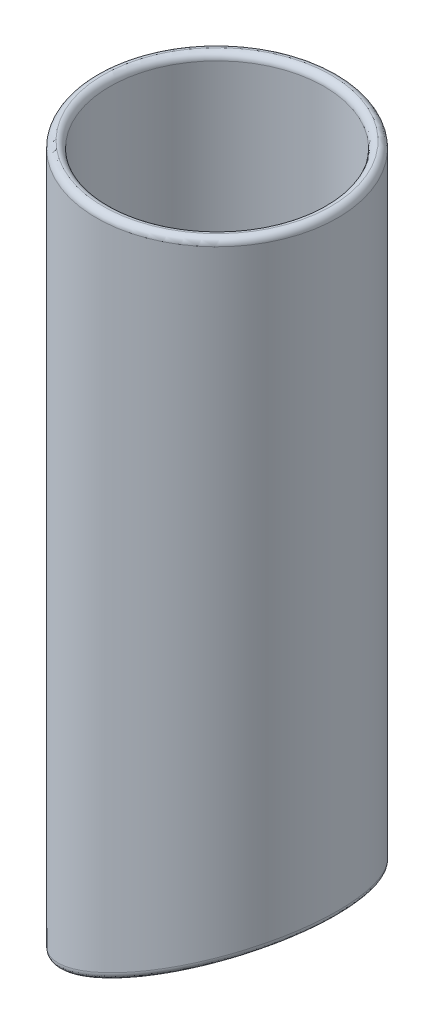
ISO-10303-21;
HEADER;
FILE_DESCRIPTION(('STEP AP214'),'2;1');
FILE_NAME('part.step','',(''),(''),'','','');
FILE_SCHEMA(('AUTOMOTIVE_DESIGN { 1 0 10303 214 1 1 1 1 }'));
ENDSEC;
DATA;
#1=APPLICATION_CONTEXT('core data for automotive mechanical design processes');
#2=APPLICATION_PROTOCOL_DEFINITION('international standard','automotive_design',2000,#1);
#3=PRODUCT_CONTEXT('',#1,'mechanical');
#4=PRODUCT('Part','Part','',(#3));
#5=PRODUCT_RELATED_PRODUCT_CATEGORY('part','',(#4));
#6=PRODUCT_DEFINITION_FORMATION('','',#4);
#7=PRODUCT_DEFINITION_CONTEXT('part definition',#1,'design');
#8=PRODUCT_DEFINITION('design','',#6,#7);
#9=PRODUCT_DEFINITION_SHAPE('','',#8);
#10=(LENGTH_UNIT() NAMED_UNIT(*) SI_UNIT(.MILLI.,.METRE.));
#11=(NAMED_UNIT(*) PLANE_ANGLE_UNIT() SI_UNIT($,.RADIAN.));
#12=(NAMED_UNIT(*) SI_UNIT($,.STERADIAN.) SOLID_ANGLE_UNIT());
#13=UNCERTAINTY_MEASURE_WITH_UNIT(LENGTH_MEASURE(1.E-05),#10,'distance_accuracy_value','');
#14=(GEOMETRIC_REPRESENTATION_CONTEXT(3) GLOBAL_UNCERTAINTY_ASSIGNED_CONTEXT((#13)) GLOBAL_UNIT_ASSIGNED_CONTEXT((#10,
#11,#12)) REPRESENTATION_CONTEXT('',''));
#15=CARTESIAN_POINT('',(0.,0.,0.));
#16=DIRECTION('',(0.,0.,1.));
#17=DIRECTION('',(1.,0.,0.));
#18=AXIS2_PLACEMENT_3D('',#15,#16,#17);
#19=CARTESIAN_POINT('',(0.,0.,0.));
#20=DIRECTION('',(0.,-1.,0.));
#21=DIRECTION('',(0.,0.,-1.));
#22=AXIS2_PLACEMENT_3D('',#19,#20,#21);
#23=CYLINDRICAL_SURFACE('',#22,2.032);
#24=CARTESIAN_POINT('',(0.,6.66237066588943,0.));
#25=DIRECTION('',(-0.422618261740694,0.906307787036652,0.));
#26=DIRECTION('',(-0.906307787036652,-0.422618261740694,0.));
#27=AXIS2_PLACEMENT_3D('',#24,#25,#26);
#28=ELLIPSE('',#27,2.24206393133178,2.032);
#29=CARTESIAN_POINT('',(-2.032,5.71483350451849,0.));
#30=VERTEX_POINT('',#29);
#31=EDGE_CURVE('E85',#30,#30,#28,.F.);
#32=ORIENTED_EDGE('',*,*,#31,.T.);
#33=EDGE_LOOP('',(#32));
#34=FACE_BOUND('',#33,.T.);
#35=CARTESIAN_POINT('',(0.,14.2343500797453,0.));
#36=DIRECTION('',(0.,-1.,0.));
#37=DIRECTION('',(0.,0.,-1.));
#38=AXIS2_PLACEMENT_3D('',#35,#36,#37);
#39=CIRCLE('',#38,2.032);
#40=CARTESIAN_POINT('',(0.,14.2343500797453,-2.032));
#41=VERTEX_POINT('',#40);
#42=EDGE_CURVE('E88',#41,#41,#39,.T.);
#43=ORIENTED_EDGE('',*,*,#42,.F.);
#44=EDGE_LOOP('',(#43));
#45=FACE_BOUND('',#44,.T.);
#46=ADVANCED_FACE('F33',(#34,#45),#23,.F.);
#47=CARTESIAN_POINT('',(0.,14.2343500797453,0.));
#48=DIRECTION('',(0.,1.,0.));
#49=DIRECTION('',(0.,0.,1.));
#50=AXIS2_PLACEMENT_3D('',#47,#48,#49);
#51=CONICAL_SURFACE('',#50,2.032,1.02974425867666);
#52=CARTESIAN_POINT('',(0.,15.875,0.));
#53=DIRECTION('',(0.,-1.,0.));
#54=DIRECTION('',(0.,0.,-1.));
#55=AXIS2_PLACEMENT_3D('',#52,#53,#54);
#56=CIRCLE('',#55,4.7625);
#57=CARTESIAN_POINT('',(0.,15.875,-4.7625));
#58=VERTEX_POINT('',#57);
#59=EDGE_CURVE('E91',#58,#58,#56,.T.);
#60=ORIENTED_EDGE('',*,*,#59,.F.);
#61=EDGE_LOOP('',(#60));
#62=FACE_BOUND('',#61,.T.);
#63=ORIENTED_EDGE('',*,*,#42,.T.);
#64=EDGE_LOOP('',(#63));
#65=FACE_BOUND('',#64,.T.);
#66=ADVANCED_FACE('F75',(#62,#65),#51,.F.);
#67=CARTESIAN_POINT('',(-4.7625,15.875,0.));
#68=DIRECTION('',(0.,-1.,0.));
#69=DIRECTION('',(0.,0.,-1.));
#70=AXIS2_PLACEMENT_3D('',#67,#68,#69);
#71=PLANE('',#70);
#72=CARTESIAN_POINT('',(0.,15.875,0.));
#73=DIRECTION('',(0.,-1.,0.));
#74=DIRECTION('',(0.,0.,-1.));
#75=AXIS2_PLACEMENT_3D('',#72,#73,#74);
#76=CIRCLE('',#75,11.90625);
#77=CARTESIAN_POINT('',(0.,15.875,-11.90625));
#78=VERTEX_POINT('',#77);
#79=EDGE_CURVE('E10',#78,#78,#76,.F.);
#80=ORIENTED_EDGE('',*,*,#79,.T.);
#81=EDGE_LOOP('',(#80));
#82=FACE_BOUND('',#81,.T.);
#83=ORIENTED_EDGE('',*,*,#59,.T.);
#84=EDGE_LOOP('',(#83));
#85=FACE_BOUND('',#84,.T.);
#86=ADVANCED_FACE('F80',(#82,#85),#71,.F.);
#87=CARTESIAN_POINT('',(0.,0.,0.));
#88=DIRECTION('',(0.,-1.,0.));
#89=DIRECTION('',(0.,0.,-1.));
#90=AXIS2_PLACEMENT_3D('',#87,#88,#89);
#91=CYLINDRICAL_SURFACE('',#90,12.7);
#92=CARTESIAN_POINT('',(0.,16.66875,0.));
#93=DIRECTION('',(0.,-1.,0.));
#94=DIRECTION('',(0.,0.,-1.));
#95=AXIS2_PLACEMENT_3D('',#92,#93,#94);
#96=CIRCLE('',#95,12.7);
#97=CARTESIAN_POINT('',(0.,16.66875,-12.7));
#98=VERTEX_POINT('',#97);
#99=EDGE_CURVE('E41',#98,#98,#96,.T.);
#100=ORIENTED_EDGE('',*,*,#99,.T.);
#101=EDGE_LOOP('',(#100));
#102=FACE_BOUND('',#101,.T.);
#103=CARTESIAN_POINT('',(0.,84.93125,0.));
#104=DIRECTION('',(0.,-1.,0.));
#105=DIRECTION('',(0.,0.,-1.));
#106=AXIS2_PLACEMENT_3D('',#103,#104,#105);
#107=CIRCLE('',#106,12.7);
#108=CARTESIAN_POINT('',(0.,84.93125,-12.7));
#109=VERTEX_POINT('',#108);
#110=EDGE_CURVE('E46',#109,#109,#107,.F.);
#111=ORIENTED_EDGE('',*,*,#110,.T.);
#112=EDGE_LOOP('',(#111));
#113=FACE_BOUND('',#112,.T.);
#114=ADVANCED_FACE('F70',(#102,#113),#91,.F.);
#115=CARTESIAN_POINT('',(0.,0.,0.));
#116=DIRECTION('',(0.,-1.,0.));
#117=DIRECTION('',(0.,0.,-1.));
#118=AXIS2_PLACEMENT_3D('',#115,#116,#117);
#119=CYLINDRICAL_SURFACE('',#118,14.2875);
#120=CARTESIAN_POINT('',(0.,7.53817688906591,0.));
#121=DIRECTION('',(0.403046572933463,-0.91517946876369,0.));
#122=DIRECTION('',(-0.91517946876369,-0.403046572933463,0.));
#123=AXIS2_PLACEMENT_3D('',#120,#121,#122);
#124=ELLIPSE('',#123,15.611692009766,14.2875);
#125=CARTESIAN_POINT('',(-14.2875,1.245937926837,0.));
#126=VERTEX_POINT('',#125);
#127=EDGE_CURVE('E94',#126,#126,#124,.F.);
#128=ORIENTED_EDGE('',*,*,#127,.T.);
#129=EDGE_LOOP('',(#128));
#130=FACE_BOUND('',#129,.T.);
#131=CARTESIAN_POINT('',(0.,84.93125,0.));
#132=DIRECTION('',(0.,-1.,0.));
#133=DIRECTION('',(0.,0.,-1.));
#134=AXIS2_PLACEMENT_3D('',#131,#132,#133);
#135=CIRCLE('',#134,14.2875);
#136=CARTESIAN_POINT('',(0.,84.93125,-14.2875));
#137=VERTEX_POINT('',#136);
#138=EDGE_CURVE('E90',#137,#137,#135,.T.);
#139=ORIENTED_EDGE('',*,*,#138,.T.);
#140=EDGE_LOOP('',(#139));
#141=FACE_BOUND('',#140,.T.);
#142=ADVANCED_FACE('F61',(#130,#141),#119,.T.);
#143=CARTESIAN_POINT('',(-14.2875,0.,-14.2875));
#144=DIRECTION('',(-0.422618261740694,0.906307787036652,0.));
#145=DIRECTION('',(-0.906307787036652,-0.422618261740694,0.));
#146=AXIS2_PLACEMENT_3D('',#143,#144,#145);
#147=PLANE('',#146);
#148=CARTESIAN_POINT('',(0.335453245256676,6.81879508310557,0.));
#149=DIRECTION('',(-0.422618261740694,0.906307787036652,0.));
#150=DIRECTION('',(-0.906307787036652,-0.422618261740694,0.));
#151=AXIS2_PLACEMENT_3D('',#148,#149,#150);
#152=ELLIPSE('',#151,14.8887057940001,13.49375);
#153=CARTESIAN_POINT('',(-13.1582967547433,0.526556120876657,0.));
#154=VERTEX_POINT('',#153);
#155=EDGE_CURVE('E102',#154,#154,#152,.F.);
#156=ORIENTED_EDGE('',*,*,#155,.T.);
#157=EDGE_LOOP('',(#156));
#158=FACE_BOUND('',#157,.T.);
#159=ORIENTED_EDGE('',*,*,#31,.F.);
#160=EDGE_LOOP('',(#159));
#161=FACE_BOUND('',#160,.T.);
#162=ADVANCED_FACE('F58',(#158,#161),#147,.F.);
#163=CARTESIAN_POINT('',(-13.1582967547433,0.526556120876656,0.));
#164=CARTESIAN_POINT('',(-13.5529631282506,0.342520168493962,0.));
#165=CARTESIAN_POINT('',(-13.9202315641253,0.576495966723023,0.));
#166=CARTESIAN_POINT('',(-14.2875,0.810471764952084,0.));
#167=CARTESIAN_POINT('',(-14.2875,1.245937926837,0.));
#168=CARTESIAN_POINT('',(-13.1582967547433,0.526556120876656,0.589136733048531));
#169=CARTESIAN_POINT('',(-13.5529631282506,0.342520168493962,0.6101158247592));
#170=CARTESIAN_POINT('',(-13.9202315641253,0.576495966723023,0.621385296451688));
#171=CARTESIAN_POINT('',(-14.2875,0.810471764952084,0.632658593852278));
#172=CARTESIAN_POINT('',(-14.2875,1.245937926837,0.623791834992562));
#173=CARTESIAN_POINT('',(-13.1196099817856,0.544596059376123,1.17827346609706));
#174=CARTESIAN_POINT('',(-13.5126080024159,0.361338072716476,1.22000753030205));
#175=CARTESIAN_POINT('',(-13.8789707807395,0.595241654864077,1.24277059290338));
#176=CARTESIAN_POINT('',(-14.2453941149126,0.829117725085487,1.2650847876544));
#177=CARTESIAN_POINT('',(-14.2465375345154,1.26397786533647,1.24758366998513));
#178=CARTESIAN_POINT('',(-12.9658205906878,0.616309230188049,2.34643759857271));
#179=CARTESIAN_POINT('',(-13.3521582612219,0.436157015784255,2.42924383563759));
#180=CARTESIAN_POINT('',(-13.715053674377,0.669720834947142,2.47428104113633));
#181=CARTESIAN_POINT('',(-14.0780075038693,0.903258108515863,2.51887325768736));
#182=CARTESIAN_POINT('',(-14.0837017086471,1.33569103614839,2.48446333966522));
#183=CARTESIAN_POINT('',(-12.8504385972863,0.670112737324339,2.92542006592961));
#184=CARTESIAN_POINT('',(-13.231887689451,0.492240104451686,3.02811772643131));
#185=CARTESIAN_POINT('',(-13.5920997711564,0.725589553514145,3.08435661303703));
#186=CARTESIAN_POINT('',(-13.9525432497681,0.958833845005238,3.1397471057216));
#187=CARTESIAN_POINT('',(-13.9615325391632,1.38949454328468,3.09750359921958));
#188=CARTESIAN_POINT('',(-12.5455127130073,0.812302012333345,4.06343523255316));
#189=CARTESIAN_POINT('',(-12.9140996196775,0.640427115057366,4.20464836376069));
#190=CARTESIAN_POINT('',(-13.2674891250261,0.873113989752056,4.28237971803112));
#191=CARTESIAN_POINT('',(-13.6211086158631,1.1056963394755,4.35925663564154));
#192=CARTESIAN_POINT('',(-13.6386698381618,1.53168381829369,4.30246083446805));
#193=CARTESIAN_POINT('',(-12.3554544235883,0.900927648185255,4.62229955781147));
#194=CARTESIAN_POINT('',(-12.7162609247608,0.732680813576391,4.78177483897237));
#195=CARTESIAN_POINT('',(-13.065286511824,0.965017922269999,4.87014207254615));
#196=CARTESIAN_POINT('',(-13.4148035706244,1.19713160330242,4.95734129867704));
#197=CARTESIAN_POINT('',(-13.4374316493652,1.6203094541456,4.89419953180038));
#198=CARTESIAN_POINT('',(-11.9046472936457,1.11114246522836,5.71065840140507));
#199=CARTESIAN_POINT('',(-12.2472271701904,0.951394845265751,5.90470037027031));
#200=CARTESIAN_POINT('',(-12.5862898772323,1.18277811887235,6.01329808237527));
#201=CARTESIAN_POINT('',(-12.9258477016013,1.41393629957115,6.12070920637767));
#202=CARTESIAN_POINT('',(-12.9601064529555,1.8305242711887,6.04657948384066));
#203=CARTESIAN_POINT('',(-11.6432261915507,1.23304512713856,6.23981277797392));
#204=CARTESIAN_POINT('',(-11.9756183210071,1.0780481316626,6.44989302331799));
#205=CARTESIAN_POINT('',(-12.3087866554277,1.30895720783238,6.56831955129968));
#206=CARTESIAN_POINT('',(-12.6427664879707,1.53949720260842,6.68536154020252));
#207=CARTESIAN_POINT('',(-12.6833076389725,1.9524269330989,6.60686058844297));
#208=CARTESIAN_POINT('',(-11.0542969832435,1.50766732708335,7.25987981693784));
#209=CARTESIAN_POINT('',(-11.3641810349775,1.36316602061972,7.49957643147618));
#210=CARTESIAN_POINT('',(-11.6845468861868,1.59287214018713,7.63654706670601));
#211=CARTESIAN_POINT('',(-12.0057366913275,1.82220350954303,7.77210354349577));
#212=CARTESIAN_POINT('',(-12.0597355360591,2.2270491330437,7.68693157087536));
#213=CARTESIAN_POINT('',(-10.7260502663417,1.66073128493891,7.75027162005623));
#214=CARTESIAN_POINT('',(-11.0239070635444,1.52183837936978,8.00339393351332));
#215=CARTESIAN_POINT('',(-11.3370370631392,1.75096048715353,8.14918681842504));
#216=CARTESIAN_POINT('',(-11.6513258174134,1.97955529740255,8.29349232905361));
#217=CARTESIAN_POINT('',(-11.7121801887512,2.38011309089926,8.20616995064777));
#218=CARTESIAN_POINT('',(-10.009120128479,1.99504129858641,8.68460246961093));
#219=CARTESIAN_POINT('',(-10.2813677834211,1.86809013217216,8.96181207927427));
#220=CARTESIAN_POINT('',(-10.5792207510539,2.09580826767026,9.12410735689081));
#221=CARTESIAN_POINT('',(-10.8782552481107,2.32298874372169,9.28487923234796));
#222=CARTESIAN_POINT('',(-10.9530776898378,2.71442310454675,9.19546143841157));
#223=CARTESIAN_POINT('',(-9.61971877820014,2.17662213031733,9.12786870641347));
#224=CARTESIAN_POINT('',(-9.87868075652248,2.05586617665466,9.41570523075503));
#225=CARTESIAN_POINT('',(-10.1681693487319,2.2829078999908,9.58566185112669));
#226=CARTESIAN_POINT('',(-10.4591593176239,2.50926601500165,9.75414086344827));
#227=CARTESIAN_POINT('',(-10.5407703777778,2.89600393627768,9.66480215973191));
#228=CARTESIAN_POINT('',(-8.78709018827014,2.56488321820049,9.96050439658816));
#229=CARTESIAN_POINT('',(-9.01849117093127,2.45697916788101,10.2667072273733));
#230=CARTESIAN_POINT('',(-9.2906350561541,2.68246570318227,10.450844617827));
#231=CARTESIAN_POINT('',(-9.56431200346145,2.90725421002265,10.633467863342));
#232=CARTESIAN_POINT('',(-9.65916363549898,3.28426502416083,10.5464164199169));
#233=CARTESIAN_POINT('',(-8.34323416589167,2.77185668055378,10.3491059677361));
#234=CARTESIAN_POINT('',(-8.56063150065711,2.67048263849017,10.6631225684247));
#235=CARTESIAN_POINT('',(-8.82350629217701,2.89521950238592,10.8536500642144));
#236=CARTESIAN_POINT('',(-9.08819259595808,3.11913103812063,11.0428117237522));
#237=CARTESIAN_POINT('',(-9.18919843533354,3.49123848651412,10.9578769070147));
#238=CARTESIAN_POINT('',(-7.4091759106834,3.20741519812029,11.0658393028397));
#239=CARTESIAN_POINT('',(-7.59808891356375,3.11932361815212,11.3926182628087));
#240=CARTESIAN_POINT('',(-7.84197919236888,3.3424022461521,11.5948008814095));
#241=CARTESIAN_POINT('',(-8.08771762988532,3.56463885999947,11.7955859027784));
#242=CARTESIAN_POINT('',(-8.20019557687772,3.92679700408063,11.7167710265362));
#243=CARTESIAN_POINT('',(-6.91847668359914,3.43623200556041,11.3931801500763));
#244=CARTESIAN_POINT('',(-7.09313516671646,3.35478741732107,11.7250736394148));
#245=CARTESIAN_POINT('',(-7.3270760849554,3.5770628630688,11.932304828724));
#246=CARTESIAN_POINT('',(-7.56308420043482,3.79839589722641,12.138366617583));
#247=CARTESIAN_POINT('',(-7.68063168937675,4.15561381152075,12.0633672177279));
#248=CARTESIAN_POINT('',(-5.89897823247016,3.91163194079901,11.9817915599977));
#249=CARTESIAN_POINT('',(-6.04508973386338,3.84349902875482,12.3211772294159));
#250=CARTESIAN_POINT('',(-6.2588378300724,4.06405753778476,12.537405751105));
#251=CARTESIAN_POINT('',(-6.47468931292327,4.28365714838217,12.7524412458758));
#252=CARTESIAN_POINT('',(-6.60116274112253,4.63101374675935,12.6866028282329));
#253=CARTESIAN_POINT('',(-5.36982952937074,4.15837803335705,12.2423230087605));
#254=CARTESIAN_POINT('',(-5.50181596862913,4.09683174595825,12.5843216184115));
#255=CARTESIAN_POINT('',(-5.70515240838958,4.31655291330202,12.8042216910541));
#256=CARTESIAN_POINT('',(-5.91074197515436,4.53524626326239,13.0232120836077));
#257=CARTESIAN_POINT('',(-6.04088764372315,4.87775983931739,12.9624596563347));
#258=CARTESIAN_POINT('',(-4.28232833576912,4.66548816818617,12.6927832458271));
#259=CARTESIAN_POINT('',(-4.38638577212791,4.6169653887241,13.0374680677799));
#260=CARTESIAN_POINT('',(-4.56874294650122,4.83495029044023,13.2636406561483));
#261=CARTESIAN_POINT('',(-4.75338339876401,5.05189363186443,13.4888889760032));
#262=CARTESIAN_POINT('',(-4.88941579167438,5.38486997414652,13.4394175544052));
#263=CARTESIAN_POINT('',(-3.72376575205907,4.92595017852901,12.8820927464524));
#264=CARTESIAN_POINT('',(-3.81412178450605,4.88381646863848,13.2271321517392));
#265=CARTESIAN_POINT('',(-3.98581199245326,5.1009480470891,13.4555932354724));
#266=CARTESIAN_POINT('',(-4.15986282921457,5.31700211389477,13.6834445611066));
#267=CARTESIAN_POINT('',(-4.29799658539314,5.64533198448935,13.6398629080084));
#268=CARTESIAN_POINT('',(-2.58685126146267,5.45610211216149,13.1867295920233));
#269=CARTESIAN_POINT('',(-2.65040793951802,5.42646514645739,13.5301742839364));
#270=CARTESIAN_POINT('',(-2.8007353702674,5.64187516151831,13.7621731086067));
#271=CARTESIAN_POINT('',(-2.95344295806624,5.85619876096548,13.9935552460835));
#272=CARTESIAN_POINT('',(-3.09420477182048,6.17548391812184,13.9624195680247));
#273=CARTESIAN_POINT('',(-2.00840177411341,5.72583753796828,13.3016123090304));
#274=CARTESIAN_POINT('',(-2.05889777583083,5.70229086566124,13.6434131099732));
#275=CARTESIAN_POINT('',(-2.19849637759075,5.91684807355184,13.8763358896801));
#276=CARTESIAN_POINT('',(-2.34048211142711,6.13031504010427,14.1089660941116));
#277=CARTESIAN_POINT('',(-2.48172884403892,6.44521934392862,14.0840600919145));
#278=CARTESIAN_POINT('',(-0.841500453127908,6.269972560255,13.4552385045));
#279=CARTESIAN_POINT('',(-0.866692946195837,6.25822510780941,13.7916995096748));
#280=CARTESIAN_POINT('',(-0.984923296237002,6.47110429644572,14.025464118711));
#281=CARTESIAN_POINT('',(-1.10554689567887,6.68289045766899,14.2589338732331));
#282=CARTESIAN_POINT('',(-1.24618626887779,6.98935436621534,14.2467231224118));
#283=CARTESIAN_POINT('',(-0.253023603935617,6.54438382168028,13.49375));
#284=CARTESIAN_POINT('',(-0.265948837384549,6.5383566863396,13.8268254217779));
#285=CARTESIAN_POINT('',(-0.373567162478764,6.7503981511022,14.0601883152934));
#286=CARTESIAN_POINT('',(-0.483520856480465,6.96137243419217,14.2935716471427));
#287=CARTESIAN_POINT('',(-0.623093134438898,7.26376562764062,14.2875));
#288=CARTESIAN_POINT('',(0.923930094448967,7.09320634453085,13.49375));
#289=CARTESIAN_POINT('',(0.934564054482364,7.09816504153094,13.8182549658795));
#290=CARTESIAN_POINT('',(0.847969691462821,7.30859612051606,14.0498436998403));
#291=CARTESIAN_POINT('',(0.759047883620705,7.5179636446667,14.2814514851412));
#292=CARTESIAN_POINT('',(0.623093134438896,7.8125881504912,14.2875));
#293=CARTESIAN_POINT('',(1.51240694364126,7.36761760595614,13.4552385045));
#294=CARTESIAN_POINT('',(1.53441300217358,7.37787919957557,13.774857794538));
#295=CARTESIAN_POINT('',(1.45815041164617,7.58750023527344,14.0047748878048));
#296=CARTESIAN_POINT('',(1.37967535937361,7.79610974306281,14.2350023059683));
#297=CARTESIAN_POINT('',(1.24618626887779,8.08699941191648,14.2467231224118));
#298=CARTESIAN_POINT('',(2.67930826462676,7.91175262824285,13.3016123090304));
#299=CARTESIAN_POINT('',(2.72297149224672,7.93211312566181,13.6099053054236));
#300=CARTESIAN_POINT('',(2.66706861131643,8.14021129823736,13.8355463131893));
#301=CARTESIAN_POINT('',(2.60897375939653,8.34730731515266,14.0614935479742));
#302=CARTESIAN_POINT('',(2.48172884403892,8.6311344342032,14.0840600919145));
#303=CARTESIAN_POINT('',(3.25775775197602,8.18148805404964,13.1867295920233));
#304=CARTESIAN_POINT('',(3.31183471680819,8.20670455688066,13.4888569051684));
#305=CARTESIAN_POINT('',(3.26583511357372,8.41403110904785,13.7116261159108));
#306=CARTESIAN_POINT('',(3.21780651871648,8.62042958681903,13.9349565643329));
#307=CARTESIAN_POINT('',(3.09420477182048,8.90086986000999,13.9624195680247));
#308=CARTESIAN_POINT('',(4.39467224257242,8.71163998768212,12.8820927464524));
#309=CARTESIAN_POINT('',(4.46841376553116,8.7460262245618,13.1705649844248));
#310=CARTESIAN_POINT('',(4.44181974663901,8.95193368489759,13.3866984435352));
#311=CARTESIAN_POINT('',(4.4132266053991,9.15692673560986,13.6033836493112));
#312=CARTESIAN_POINT('',(4.29799658539314,9.43102179364246,13.6398629080084));
#313=CARTESIAN_POINT('',(4.95323482628247,8.97210199802496,12.6927832458271));
#314=CARTESIAN_POINT('',(5.03639646542338,9.01088090722108,12.9740060051194));
#315=CARTESIAN_POINT('',(5.01914395828065,9.21606427183073,13.1861489506887));
#316=CARTESIAN_POINT('',(5.0000933553792,9.42042483274172,13.3990527309615));
#317=CARTESIAN_POINT('',(4.88941579167437,9.6914838039853,13.4394175544052));
#318=CARTESIAN_POINT('',(6.04073601988409,9.47921213285409,12.2423230087605));
#319=CARTESIAN_POINT('',(6.14152672998225,9.52621161284374,12.5079395878977));
#320=CARTESIAN_POINT('',(6.14246542073052,9.73009277279648,12.7112526039638));
#321=CARTESIAN_POINT('',(6.14164099404263,9.9331671360635,12.9153103346317));
#322=CARTESIAN_POINT('',(6.04088764372314,10.1985939388144,12.9624596563347));
#323=CARTESIAN_POINT('',(6.56988472298351,9.72595822541213,11.9817915599977));
#324=CARTESIAN_POINT('',(6.67908598244757,9.77687960898039,12.2392474141405));
#325=CARTESIAN_POINT('',(6.68868579156646,9.98009192558086,12.4375423327535));
#326=CARTESIAN_POINT('',(6.69675098663304,10.1826017466229,12.6367377401063));
#327=CARTESIAN_POINT('',(6.60116274112253,10.4453400313725,12.6866028282329));
#328=CARTESIAN_POINT('',(7.58938317411249,10.2013581606507,11.3931801500763));
#329=CARTESIAN_POINT('',(7.71416760635714,10.2595460970249,11.6334093276354));
#330=CARTESIAN_POINT('',(7.7405126803569,10.461583512346,11.8208647903622));
#331=CARTESIAN_POINT('',(7.76535864042779,10.6629346828211,12.009198424486));
#332=CARTESIAN_POINT('',(7.68063168937675,10.9207399666111,12.0633672177279));
#333=CARTESIAN_POINT('',(8.08008240119675,10.4301749680908,11.0658393028397));
#334=CARTESIAN_POINT('',(8.21226441611791,10.4918124539189,11.2971471587833));
#335=CARTESIAN_POINT('',(8.24648587419344,10.6932429097205,11.4786560559373));
#336=CARTESIAN_POINT('',(8.27945304563135,10.8940990080595,11.6611403102794));
#337=CARTESIAN_POINT('',(8.20019557687772,11.1495567740512,11.7167710265362));
#338=CARTESIAN_POINT('',(9.01414065640502,10.8657334856574,10.3491059677361));
#339=CARTESIAN_POINT('',(9.15987040289014,10.9336883824644,10.5618545970247));
#340=CARTESIAN_POINT('',(9.20918729934172,11.1340793172856,10.7307150607673));
#341=CARTESIAN_POINT('',(9.25728180651524,11.3339104999919,10.9005243565676));
#342=CARTESIAN_POINT('',(9.18919843533354,11.5851152916177,10.9578769070147));
#343=CARTESIAN_POINT('',(9.45799667878349,11.0727069480106,9.96050439658816));
#344=CARTESIAN_POINT('',(9.61011504047215,11.1436409050121,10.1637024887836));
#345=CARTESIAN_POINT('',(9.66643316413252,11.3434925537736,10.3257934983713));
#346=CARTESIAN_POINT('',(9.72177829220195,11.542898528228,10.4888688450295));
#347=CARTESIAN_POINT('',(9.65916363549898,11.792088753971,10.5464164199169));
#348=CARTESIAN_POINT('',(10.2906252687135,11.4609680358938,9.12786870641348));
#349=CARTESIAN_POINT('',(10.4542786160439,11.5372808450366,9.31142562258496));
#350=CARTESIAN_POINT('',(10.5238650727023,11.7362343968389,9.45927308185353));
#351=CARTESIAN_POINT('',(10.592503843886,11.9347538658463,9.60807725907706));
#352=CARTESIAN_POINT('',(10.5407703777778,12.1803498418541,9.66480215973192));
#353=CARTESIAN_POINT('',(10.6800266189923,11.6425488676247,8.68460246961093));
#354=CARTESIAN_POINT('',(10.8490672332559,11.7213738005951,8.85809479837856));
#355=CARTESIAN_POINT('',(10.9247028697549,11.9198608870245,8.99846058123458));
#356=CARTESIAN_POINT('',(10.9996324640898,12.1180244997277,9.13975627626353));
#357=CARTESIAN_POINT('',(10.9530776898378,12.3619306735851,9.19546143841157));
#358=CARTESIAN_POINT('',(11.3969567568551,11.9768588812722,7.75027162005623));
#359=CARTESIAN_POINT('',(11.5755482043039,12.0601374408986,7.90325960553605));
#360=CARTESIAN_POINT('',(11.6624735315571,12.2578721441987,8.02801185484073));
#361=CARTESIAN_POINT('',(11.7487101478255,12.4552913120066,8.15366883962046));
#362=CARTESIAN_POINT('',(11.7121801887512,12.6962406872326,8.20616995064778));
#363=CARTESIAN_POINT('',(11.7252034737569,12.1299228391278,7.25987981693784));
#364=CARTESIAN_POINT('',(11.9081894433743,12.2152505980953,7.40239129497749));
#365=CARTESIAN_POINT('',(12.0001481230708,12.4125962782991,7.51906414815308));
#366=CARTESIAN_POINT('',(12.091639345186,12.6097277519186,7.63655488386211));
#367=CARTESIAN_POINT('',(12.0597355360591,12.8493046450881,7.68693157087536));
#368=CARTESIAN_POINT('',(12.3141326820641,12.4045450390726,6.23981277797392));
#369=CARTESIAN_POINT('',(12.5047151777498,12.4934151163211,6.36114908909689));
#370=CARTESIAN_POINT('',(12.6058585096949,12.6901569447389,6.46107318508244));
#371=CARTESIAN_POINT('',(12.706544056778,12.8866889967519,6.56179553239198));
#372=CARTESIAN_POINT('',(12.6833076389726,13.1239268450329,6.60686058844297));
#373=CARTESIAN_POINT('',(12.575553784159,12.5264477009828,5.71065840140507));
#374=CARTESIAN_POINT('',(12.7695459636019,12.6169077398791,5.82119847792233));
#375=CARTESIAN_POINT('',(12.8746556820153,12.8133420978536,5.91256268541022));
#376=CARTESIAN_POINT('',(12.9794960384676,13.0096530062109,6.00458384864316));
#377=CARTESIAN_POINT('',(12.9601064529555,13.2458295069431,6.04657948384066));
#378=CARTESIAN_POINT('',(13.0263609141016,12.7366625180259,4.62229955781148));
#379=CARTESIAN_POINT('',(13.2260229814135,12.8297664690565,4.71116465889378));
#380=CARTESIAN_POINT('',(13.3381107875463,13.0257471568741,4.78488783216413));
#381=CARTESIAN_POINT('',(13.4499330000807,13.2216061200504,4.85925571553858));
#382=CARTESIAN_POINT('',(13.4374316493652,13.4560443239862,4.89419953180039));
#383=CARTESIAN_POINT('',(13.2164192035206,12.8252881538778,4.06343523255316));
#384=CARTESIAN_POINT('',(13.4185124232938,12.9195257699192,4.14126946577996));
#385=CARTESIAN_POINT('',(13.533460643611,13.1152840479811,4.20607127058247));
#386=CARTESIAN_POINT('',(13.6482874536863,13.310986677748,4.27133125909004));
#387=CARTESIAN_POINT('',(13.6386698381618,13.5446699598381,4.30246083446806));
#388=CARTESIAN_POINT('',(13.5213450877997,12.9674774288868,2.92542006592961));
#389=CARTESIAN_POINT('',(13.7272045006087,13.0634712495829,2.98123406725668));
#390=CARTESIAN_POINT('',(13.846847642759,13.2589268525153,3.02775226241401));
#391=CARTESIAN_POINT('',(13.9663697728855,13.4543269880543,3.07472378217143));
#392=CARTESIAN_POINT('',(13.9615325391632,13.6868592348471,3.09750359921959));
#393=CARTESIAN_POINT('',(13.6367270812011,13.0212809360231,2.34643759857272));
#394=CARTESIAN_POINT('',(13.8440435082537,13.117954173619,2.39106652785658));
#395=CARTESIAN_POINT('',(13.9654137051503,13.3132751592522,2.42842193855671));
#396=CARTESIAN_POINT('',(14.086753516508,13.5085822170601,2.46601160540287));
#397=CARTESIAN_POINT('',(14.0837017086471,13.7406627419834,2.48446333966523));
#398=CARTESIAN_POINT('',(13.790516472299,13.092994106835,1.17827346609707));
#399=CARTESIAN_POINT('',(13.9997117474873,13.1905434657052,1.20067971713581));
#400=CARTESIAN_POINT('',(14.1234423127454,13.3857130770474,1.21936379196671));
#401=CARTESIAN_POINT('',(14.247141952376,13.5808685121075,1.23828270230306));
#402=CARTESIAN_POINT('',(14.2465375345154,13.8123759127954,1.24758366998513));
#403=CARTESIAN_POINT('',(13.8292032452567,13.1110340453345,0.589136733048536));
#404=CARTESIAN_POINT('',(14.0388839202279,13.2088097498407,0.600281420151639));
#405=CARTESIAN_POINT('',(14.163191960114,13.4039342871695,0.609681895983356));
#406=CARTESIAN_POINT('',(14.2875,13.5990588244984,0.61908108255618));
#407=CARTESIAN_POINT('',(14.2875,13.8304158512948,0.623791834992567));
#408=CARTESIAN_POINT('',(13.8292032452567,13.1110340453345,-0.589136733048532));
#409=CARTESIAN_POINT('',(14.0388839202279,13.2088097498407,-0.600281420151636));
#410=CARTESIAN_POINT('',(14.163191960114,13.4039342871695,-0.609681895983353));
#411=CARTESIAN_POINT('',(14.2875,13.5990588244984,-0.619081082556176));
#412=CARTESIAN_POINT('',(14.2875,13.8304158512948,-0.623791834992564));
#413=CARTESIAN_POINT('',(13.790516472299,13.092994106835,-1.17827346609707));
#414=CARTESIAN_POINT('',(13.9997117474873,13.1905434657052,-1.20067971713581));
#415=CARTESIAN_POINT('',(14.1234423127454,13.3857130770474,-1.21936379196671));
#416=CARTESIAN_POINT('',(14.247141952376,13.5808685121075,-1.23828270230305));
#417=CARTESIAN_POINT('',(14.2465375345154,13.8123759127954,-1.24758366998513));
#418=CARTESIAN_POINT('',(13.6367270812011,13.0212809360231,-2.34643759857271));
#419=CARTESIAN_POINT('',(13.8440435082537,13.117954173619,-2.39106652785658));
#420=CARTESIAN_POINT('',(13.9654137051503,13.3132751592522,-2.42842193855671));
#421=CARTESIAN_POINT('',(14.086753516508,13.5085822170601,-2.46601160540287));
#422=CARTESIAN_POINT('',(14.0837017086471,13.7406627419834,-2.48446333966523));
#423=CARTESIAN_POINT('',(13.5213450877997,12.9674774288868,-2.92542006592961));
#424=CARTESIAN_POINT('',(13.7272045006087,13.0634712495829,-2.98123406725668));
#425=CARTESIAN_POINT('',(13.846847642759,13.2589268525153,-3.02775226241401));
#426=CARTESIAN_POINT('',(13.9663697728855,13.4543269880543,-3.07472378217142));
#427=CARTESIAN_POINT('',(13.9615325391632,13.6868592348471,-3.09750359921958));
#428=CARTESIAN_POINT('',(13.2164192035206,12.8252881538778,-4.06343523255316));
#429=CARTESIAN_POINT('',(13.4185124232938,12.9195257699192,-4.14126946577995));
#430=CARTESIAN_POINT('',(13.533460643611,13.1152840479811,-4.20607127058247));
#431=CARTESIAN_POINT('',(13.6482874536863,13.310986677748,-4.27133125909004));
#432=CARTESIAN_POINT('',(13.6386698381618,13.5446699598381,-4.30246083446805));
#433=CARTESIAN_POINT('',(13.0263609141016,12.7366625180259,-4.62229955781147));
#434=CARTESIAN_POINT('',(13.2260229814136,12.8297664690565,-4.71116465889378));
#435=CARTESIAN_POINT('',(13.3381107875463,13.0257471568741,-4.78488783216412));
#436=CARTESIAN_POINT('',(13.4499330000807,13.2216061200504,-4.85925571553858));
#437=CARTESIAN_POINT('',(13.4374316493652,13.4560443239862,-4.89419953180038));
#438=CARTESIAN_POINT('',(12.5755537841591,12.5264477009828,-5.71065840140507));
#439=CARTESIAN_POINT('',(12.7695459636019,12.6169077398792,-5.82119847792233));
#440=CARTESIAN_POINT('',(12.8746556820153,12.8133420978536,-5.91256268541022));
#441=CARTESIAN_POINT('',(12.9794960384676,13.0096530062109,-6.00458384864316));
#442=CARTESIAN_POINT('',(12.9601064529555,13.2458295069431,-6.04657948384066));
#443=CARTESIAN_POINT('',(12.3141326820641,12.4045450390726,-6.23981277797392));
#444=CARTESIAN_POINT('',(12.5047151777498,12.4934151163211,-6.36114908909689));
#445=CARTESIAN_POINT('',(12.605858509695,12.6901569447389,-6.46107318508243));
#446=CARTESIAN_POINT('',(12.706544056778,12.8866889967519,-6.56179553239198));
#447=CARTESIAN_POINT('',(12.6833076389726,13.1239268450329,-6.60686058844297));
#448=CARTESIAN_POINT('',(11.7252034737569,12.1299228391278,-7.25987981693784));
#449=CARTESIAN_POINT('',(11.9081894433743,12.2152505980953,-7.40239129497749));
#450=CARTESIAN_POINT('',(12.0001481230708,12.4125962782991,-7.51906414815307));
#451=CARTESIAN_POINT('',(12.091639345186,12.6097277519186,-7.63655488386211));
#452=CARTESIAN_POINT('',(12.0597355360591,12.8493046450881,-7.68693157087536));
#453=CARTESIAN_POINT('',(11.3969567568551,11.9768588812722,-7.75027162005623));
#454=CARTESIAN_POINT('',(11.5755482043039,12.0601374408986,-7.90325960553605));
#455=CARTESIAN_POINT('',(11.6624735315571,12.2578721441987,-8.02801185484073));
#456=CARTESIAN_POINT('',(11.7487101478255,12.4552913120066,-8.15366883962046));
#457=CARTESIAN_POINT('',(11.7121801887512,12.6962406872326,-8.20616995064777));
#458=CARTESIAN_POINT('',(10.6800266189924,11.6425488676247,-8.68460246961093));
#459=CARTESIAN_POINT('',(10.8490672332559,11.7213738005951,-8.85809479837856));
#460=CARTESIAN_POINT('',(10.9247028697549,11.9198608870245,-8.99846058123458));
#461=CARTESIAN_POINT('',(10.9996324640898,12.1180244997277,-9.13975627626352));
#462=CARTESIAN_POINT('',(10.9530776898378,12.3619306735851,-9.19546143841157));
#463=CARTESIAN_POINT('',(10.2906252687135,11.4609680358938,-9.12786870641347));
#464=CARTESIAN_POINT('',(10.4542786160439,11.5372808450366,-9.31142562258495));
#465=CARTESIAN_POINT('',(10.5238650727023,11.7362343968389,-9.45927308185353));
#466=CARTESIAN_POINT('',(10.592503843886,11.9347538658463,-9.60807725907706));
#467=CARTESIAN_POINT('',(10.5407703777778,12.1803498418541,-9.66480215973191));
#468=CARTESIAN_POINT('',(9.45799667878349,11.0727069480106,-9.96050439658815));
#469=CARTESIAN_POINT('',(9.61011504047216,11.1436409050121,-10.1637024887836));
#470=CARTESIAN_POINT('',(9.66643316413252,11.3434925537736,-10.3257934983713));
#471=CARTESIAN_POINT('',(9.72177829220196,11.542898528228,-10.4888688450295));
#472=CARTESIAN_POINT('',(9.65916363549898,11.792088753971,-10.5464164199169));
#473=CARTESIAN_POINT('',(9.01414065640502,10.8657334856574,-10.3491059677361));
#474=CARTESIAN_POINT('',(9.15987040289014,10.9336883824644,-10.5618545970247));
#475=CARTESIAN_POINT('',(9.20918729934172,11.1340793172856,-10.7307150607673));
#476=CARTESIAN_POINT('',(9.25728180651524,11.3339104999919,-10.9005243565676));
#477=CARTESIAN_POINT('',(9.18919843533354,11.5851152916177,-10.9578769070147));
#478=CARTESIAN_POINT('',(8.08008240119675,10.4301749680908,-11.0658393028397));
#479=CARTESIAN_POINT('',(8.21226441611792,10.4918124539189,-11.2971471587833));
#480=CARTESIAN_POINT('',(8.24648587419344,10.6932429097205,-11.4786560559373));
#481=CARTESIAN_POINT('',(8.27945304563136,10.8940990080595,-11.6611403102794));
#482=CARTESIAN_POINT('',(8.20019557687773,11.1495567740512,-11.7167710265362));
#483=CARTESIAN_POINT('',(7.5893831741125,10.2013581606507,-11.3931801500763));
#484=CARTESIAN_POINT('',(7.71416760635715,10.2595460970249,-11.6334093276354));
#485=CARTESIAN_POINT('',(7.74051268035691,10.461583512346,-11.8208647903622));
#486=CARTESIAN_POINT('',(7.76535864042779,10.6629346828211,-12.009198424486));
#487=CARTESIAN_POINT('',(7.68063168937675,10.9207399666111,-12.0633672177279));
#488=CARTESIAN_POINT('',(6.56988472298351,9.72595822541213,-11.9817915599977));
#489=CARTESIAN_POINT('',(6.67908598244758,9.77687960898039,-12.2392474141405));
#490=CARTESIAN_POINT('',(6.68868579156647,9.98009192558086,-12.4375423327535));
#491=CARTESIAN_POINT('',(6.69675098663304,10.1826017466229,-12.6367377401063));
#492=CARTESIAN_POINT('',(6.60116274112253,10.4453400313725,-12.6866028282329));
#493=CARTESIAN_POINT('',(6.04073601988409,9.47921213285409,-12.2423230087605));
#494=CARTESIAN_POINT('',(6.14152672998225,9.52621161284374,-12.5079395878977));
#495=CARTESIAN_POINT('',(6.14246542073052,9.73009277279648,-12.7112526039638));
#496=CARTESIAN_POINT('',(6.14164099404263,9.9331671360635,-12.9153103346317));
#497=CARTESIAN_POINT('',(6.04088764372315,10.1985939388144,-12.9624596563347));
#498=CARTESIAN_POINT('',(4.95323482628247,8.97210199802496,-12.6927832458271));
#499=CARTESIAN_POINT('',(5.03639646542338,9.01088090722108,-12.9740060051194));
#500=CARTESIAN_POINT('',(5.01914395828065,9.21606427183073,-13.1861489506887));
#501=CARTESIAN_POINT('',(5.00009335537919,9.42042483274172,-13.3990527309615));
#502=CARTESIAN_POINT('',(4.88941579167437,9.6914838039853,-13.4394175544052));
#503=CARTESIAN_POINT('',(4.39467224257242,8.71163998768212,-12.8820927464524));
#504=CARTESIAN_POINT('',(4.46841376553116,8.7460262245618,-13.1705649844248));
#505=CARTESIAN_POINT('',(4.44181974663901,8.95193368489759,-13.3866984435352));
#506=CARTESIAN_POINT('',(4.4132266053991,9.15692673560986,-13.6033836493112));
#507=CARTESIAN_POINT('',(4.29799658539314,9.43102179364246,-13.6398629080084));
#508=CARTESIAN_POINT('',(3.25775775197602,8.18148805404964,-13.1867295920233));
#509=CARTESIAN_POINT('',(3.31183471680819,8.20670455688066,-13.4888569051684));
#510=CARTESIAN_POINT('',(3.26583511357372,8.41403110904785,-13.7116261159108));
#511=CARTESIAN_POINT('',(3.21780651871648,8.62042958681903,-13.9349565643329));
#512=CARTESIAN_POINT('',(3.09420477182048,8.90086986000999,-13.9624195680247));
#513=CARTESIAN_POINT('',(2.67930826462676,7.91175262824285,-13.3016123090304));
#514=CARTESIAN_POINT('',(2.72297149224672,7.93211312566181,-13.6099053054236));
#515=CARTESIAN_POINT('',(2.66706861131643,8.14021129823736,-13.8355463131893));
#516=CARTESIAN_POINT('',(2.60897375939653,8.34730731515266,-14.0614935479742));
#517=CARTESIAN_POINT('',(2.48172884403892,8.6311344342032,-14.0840600919145));
#518=CARTESIAN_POINT('',(1.51240694364126,7.36761760595614,-13.4552385045));
#519=CARTESIAN_POINT('',(1.53441300217358,7.37787919957557,-13.774857794538));
#520=CARTESIAN_POINT('',(1.45815041164617,7.58750023527344,-14.0047748878048));
#521=CARTESIAN_POINT('',(1.37967535937361,7.79610974306281,-14.2350023059683));
#522=CARTESIAN_POINT('',(1.24618626887779,8.08699941191648,-14.2467231224118));
#523=CARTESIAN_POINT('',(0.92393009444897,7.09320634453085,-13.49375));
#524=CARTESIAN_POINT('',(0.934564054482366,7.09816504153094,-13.8182549658795));
#525=CARTESIAN_POINT('',(0.847969691462824,7.30859612051606,-14.0498436998403));
#526=CARTESIAN_POINT('',(0.759047883620707,7.5179636446667,-14.2814514851412));
#527=CARTESIAN_POINT('',(0.623093134438899,7.8125881504912,-14.2875));
#528=CARTESIAN_POINT('',(-0.253023603935613,6.54438382168028,-13.49375));
#529=CARTESIAN_POINT('',(-0.265948837384545,6.53835668633961,-13.8268254217779));
#530=CARTESIAN_POINT('',(-0.37356716247876,6.7503981511022,-14.0601883152934));
#531=CARTESIAN_POINT('',(-0.48352085648046,6.96137243419218,-14.2935716471427));
#532=CARTESIAN_POINT('',(-0.623093134438894,7.26376562764063,-14.2875));
#533=CARTESIAN_POINT('',(-0.841500453127904,6.269972560255,-13.4552385045));
#534=CARTESIAN_POINT('',(-0.866692946195832,6.25822510780941,-13.7916995096748));
#535=CARTESIAN_POINT('',(-0.984923296236997,6.47110429644572,-14.025464118711));
#536=CARTESIAN_POINT('',(-1.10554689567887,6.68289045766899,-14.2589338732331));
#537=CARTESIAN_POINT('',(-1.24618626887779,6.98935436621534,-14.2467231224118));
#538=CARTESIAN_POINT('',(-2.00840177411341,5.72583753796828,-13.3016123090304));
#539=CARTESIAN_POINT('',(-2.05889777583083,5.70229086566124,-13.6434131099732));
#540=CARTESIAN_POINT('',(-2.19849637759075,5.91684807355184,-13.8763358896801));
#541=CARTESIAN_POINT('',(-2.34048211142711,6.13031504010427,-14.1089660941116));
#542=CARTESIAN_POINT('',(-2.48172884403891,6.44521934392862,-14.0840600919145));
#543=CARTESIAN_POINT('',(-2.58685126146266,5.45610211216149,-13.1867295920233));
#544=CARTESIAN_POINT('',(-2.65040793951802,5.42646514645739,-13.5301742839364));
#545=CARTESIAN_POINT('',(-2.8007353702674,5.64187516151831,-13.7621731086067));
#546=CARTESIAN_POINT('',(-2.95344295806623,5.85619876096548,-13.9935552460835));
#547=CARTESIAN_POINT('',(-3.09420477182048,6.17548391812184,-13.9624195680247));
#548=CARTESIAN_POINT('',(-3.72376575205906,4.92595017852901,-12.8820927464524));
#549=CARTESIAN_POINT('',(-3.81412178450605,4.88381646863848,-13.2271321517392));
#550=CARTESIAN_POINT('',(-3.98581199245325,5.10094804708911,-13.4555932354724));
#551=CARTESIAN_POINT('',(-4.15986282921456,5.31700211389477,-13.6834445611066));
#552=CARTESIAN_POINT('',(-4.29799658539313,5.64533198448936,-13.6398629080084));
#553=CARTESIAN_POINT('',(-4.28232833576912,4.66548816818618,-12.6927832458271));
#554=CARTESIAN_POINT('',(-4.3863857721279,4.6169653887241,-13.0374680677799));
#555=CARTESIAN_POINT('',(-4.56874294650122,4.83495029044023,-13.2636406561483));
#556=CARTESIAN_POINT('',(-4.753383398764,5.05189363186443,-13.4888889760032));
#557=CARTESIAN_POINT('',(-4.88941579167437,5.38486997414652,-13.4394175544052));
#558=CARTESIAN_POINT('',(-5.36982952937074,4.15837803335705,-12.2423230087605));
#559=CARTESIAN_POINT('',(-5.50181596862913,4.09683174595825,-12.5843216184115));
#560=CARTESIAN_POINT('',(-5.70515240838957,4.31655291330202,-12.8042216910541));
#561=CARTESIAN_POINT('',(-5.91074197515435,4.5352462632624,-13.0232120836077));
#562=CARTESIAN_POINT('',(-6.04088764372314,4.87775983931739,-12.9624596563347));
#563=CARTESIAN_POINT('',(-5.89897823247016,3.91163194079901,-11.9817915599977));
#564=CARTESIAN_POINT('',(-6.04508973386337,3.84349902875483,-12.3211772294159));
#565=CARTESIAN_POINT('',(-6.2588378300724,4.06405753778476,-12.537405751105));
#566=CARTESIAN_POINT('',(-6.47468931292327,4.28365714838217,-12.7524412458758));
#567=CARTESIAN_POINT('',(-6.60116274112253,4.63101374675935,-12.6866028282329));
#568=CARTESIAN_POINT('',(-6.91847668359914,3.43623200556041,-11.3931801500763));
#569=CARTESIAN_POINT('',(-7.09313516671646,3.35478741732107,-11.7250736394148));
#570=CARTESIAN_POINT('',(-7.32707608495539,3.57706286306881,-11.932304828724));
#571=CARTESIAN_POINT('',(-7.56308420043482,3.79839589722641,-12.138366617583));
#572=CARTESIAN_POINT('',(-7.68063168937675,4.15561381152075,-12.0633672177279));
#573=CARTESIAN_POINT('',(-7.40917591068339,3.20741519812029,-11.0658393028397));
#574=CARTESIAN_POINT('',(-7.59808891356374,3.11932361815212,-11.3926182628087));
#575=CARTESIAN_POINT('',(-7.84197919236887,3.3424022461521,-11.5948008814095));
#576=CARTESIAN_POINT('',(-8.08771762988531,3.56463885999948,-11.7955859027784));
#577=CARTESIAN_POINT('',(-8.20019557687772,3.92679700408063,-11.7167710265362));
#578=CARTESIAN_POINT('',(-8.34323416589166,2.77185668055378,-10.3491059677361));
#579=CARTESIAN_POINT('',(-8.5606315006571,2.67048263849017,-10.6631225684247));
#580=CARTESIAN_POINT('',(-8.823506292177,2.89521950238592,-10.8536500642144));
#581=CARTESIAN_POINT('',(-9.08819259595808,3.11913103812063,-11.0428117237522));
#582=CARTESIAN_POINT('',(-9.18919843533353,3.49123848651413,-10.9578769070147));
#583=CARTESIAN_POINT('',(-8.78709018827013,2.56488321820049,-9.96050439658817));
#584=CARTESIAN_POINT('',(-9.01849117093126,2.45697916788101,-10.2667072273733));
#585=CARTESIAN_POINT('',(-9.2906350561541,2.68246570318228,-10.450844617827));
#586=CARTESIAN_POINT('',(-9.56431200346144,2.90725421002265,-10.633467863342));
#587=CARTESIAN_POINT('',(-9.65916363549897,3.28426502416083,-10.5464164199169));
#588=CARTESIAN_POINT('',(-9.61971877820014,2.17662213031734,-9.12786870641348));
#589=CARTESIAN_POINT('',(-9.87868075652248,2.05586617665466,-9.41570523075503));
#590=CARTESIAN_POINT('',(-10.1681693487319,2.2829078999908,-9.58566185112669));
#591=CARTESIAN_POINT('',(-10.4591593176239,2.50926601500166,-9.75414086344828));
#592=CARTESIAN_POINT('',(-10.5407703777778,2.89600393627768,-9.66480215973192));
#593=CARTESIAN_POINT('',(-10.009120128479,1.99504129858641,-8.68460246961093));
#594=CARTESIAN_POINT('',(-10.2813677834211,1.86809013217216,-8.96181207927427));
#595=CARTESIAN_POINT('',(-10.5792207510539,2.09580826767026,-9.12410735689082));
#596=CARTESIAN_POINT('',(-10.8782552481107,2.32298874372169,-9.28487923234796));
#597=CARTESIAN_POINT('',(-10.9530776898378,2.71442310454675,-9.19546143841157));
#598=CARTESIAN_POINT('',(-10.7260502663417,1.66073128493892,-7.75027162005624));
#599=CARTESIAN_POINT('',(-11.0239070635444,1.52183837936978,-8.00339393351332));
#600=CARTESIAN_POINT('',(-11.3370370631391,1.75096048715353,-8.14918681842504));
#601=CARTESIAN_POINT('',(-11.6513258174134,1.97955529740255,-8.29349232905362));
#602=CARTESIAN_POINT('',(-11.7121801887512,2.38011309089926,-8.20616995064778));
#603=CARTESIAN_POINT('',(-11.0542969832435,1.50766732708335,-7.25987981693784));
#604=CARTESIAN_POINT('',(-11.3641810349775,1.36316602061972,-7.49957643147619));
#605=CARTESIAN_POINT('',(-11.6845468861868,1.59287214018713,-7.63654706670602));
#606=CARTESIAN_POINT('',(-12.0057366913275,1.82220350954303,-7.77210354349578));
#607=CARTESIAN_POINT('',(-12.0597355360591,2.2270491330437,-7.68693157087536));
#608=CARTESIAN_POINT('',(-11.6432261915507,1.23304512713856,-6.23981277797392));
#609=CARTESIAN_POINT('',(-11.9756183210071,1.0780481316626,-6.449893023318));
#610=CARTESIAN_POINT('',(-12.3087866554277,1.30895720783238,-6.56831955129968));
#611=CARTESIAN_POINT('',(-12.6427664879707,1.53949720260842,-6.68536154020252));
#612=CARTESIAN_POINT('',(-12.6833076389725,1.9524269330989,-6.60686058844297));
#613=CARTESIAN_POINT('',(-11.9046472936457,1.11114246522835,-5.71065840140507));
#614=CARTESIAN_POINT('',(-12.2472271701904,0.95139484526575,-5.90470037027031));
#615=CARTESIAN_POINT('',(-12.5862898772323,1.18277811887235,-6.01329808237527));
#616=CARTESIAN_POINT('',(-12.9258477016013,1.41393629957115,-6.12070920637767));
#617=CARTESIAN_POINT('',(-12.9601064529555,1.8305242711887,-6.04657948384066));
#618=CARTESIAN_POINT('',(-12.3554544235883,0.900927648185255,-4.62229955781147));
#619=CARTESIAN_POINT('',(-12.7162609247608,0.732680813576391,-4.78177483897237));
#620=CARTESIAN_POINT('',(-13.065286511824,0.965017922269999,-4.87014207254615));
#621=CARTESIAN_POINT('',(-13.4148035706244,1.19713160330242,-4.95734129867704));
#622=CARTESIAN_POINT('',(-13.4374316493652,1.6203094541456,-4.89419953180038));
#623=CARTESIAN_POINT('',(-12.5455127130073,0.812302012333345,-4.06343523255317));
#624=CARTESIAN_POINT('',(-12.9140996196775,0.640427115057367,-4.20464836376069));
#625=CARTESIAN_POINT('',(-13.2674891250261,0.873113989752057,-4.28237971803112));
#626=CARTESIAN_POINT('',(-13.6211086158631,1.1056963394755,-4.35925663564155));
#627=CARTESIAN_POINT('',(-13.6386698381618,1.53168381829369,-4.30246083446806));
#628=CARTESIAN_POINT('',(-12.8504385972863,0.670112737324339,-2.92542006592961));
#629=CARTESIAN_POINT('',(-13.231887689451,0.492240104451687,-3.02811772643132));
#630=CARTESIAN_POINT('',(-13.5920997711564,0.725589553514146,-3.08435661303704));
#631=CARTESIAN_POINT('',(-13.9525432497681,0.95883384500524,-3.13974710572161));
#632=CARTESIAN_POINT('',(-13.9615325391632,1.38949454328468,-3.09750359921959));
#633=CARTESIAN_POINT('',(-12.9658205906878,0.616309230188049,-2.34643759857272));
#634=CARTESIAN_POINT('',(-13.3521582612219,0.436157015784255,-2.4292438356376));
#635=CARTESIAN_POINT('',(-13.715053674377,0.669720834947143,-2.47428104113634));
#636=CARTESIAN_POINT('',(-14.0780075038693,0.903258108515863,-2.51887325768736));
#637=CARTESIAN_POINT('',(-14.0837017086471,1.33569103614839,-2.48446333966523));
#638=CARTESIAN_POINT('',(-13.1196099817856,0.544596059376123,-1.17827346609707));
#639=CARTESIAN_POINT('',(-13.5126080024159,0.361338072716476,-1.22000753030205));
#640=CARTESIAN_POINT('',(-13.8789707807395,0.595241654864077,-1.24277059290338));
#641=CARTESIAN_POINT('',(-14.2453941149126,0.829117725085487,-1.2650847876544));
#642=CARTESIAN_POINT('',(-14.2465375345154,1.26397786533647,-1.24758366998513));
#643=CARTESIAN_POINT('',(-13.1582967547433,0.526556120876656,-0.589136733048534));
#644=CARTESIAN_POINT('',(-13.5529631282506,0.342520168493962,-0.610115824759203));
#645=CARTESIAN_POINT('',(-13.9202315641253,0.576495966723023,-0.621385296451691));
#646=CARTESIAN_POINT('',(-14.2875,0.810471764952083,-0.632658593852281));
#647=CARTESIAN_POINT('',(-14.2875,1.245937926837,-0.623791834992565));
#648=CARTESIAN_POINT('',(-13.1582967547433,0.526556120876656,0.));
#649=CARTESIAN_POINT('',(-13.5529631282506,0.342520168493962,0.));
#650=CARTESIAN_POINT('',(-13.9202315641253,0.576495966723023,0.));
#651=CARTESIAN_POINT('',(-14.2875,0.810471764952084,0.));
#652=CARTESIAN_POINT('',(-14.2875,1.245937926837,0.));
#653=(BOUNDED_SURFACE() B_SPLINE_SURFACE(3,2,((#163,#164,#165,#166,#167),(#168,#169,#170,#171,
#172),(#173,#174,#175,#176,#177),(#178,#179,#180,#181,#182),(#183,#184,#185,#186,#187),(#188,
#189,#190,#191,#192),(#193,#194,#195,#196,#197),(#198,#199,#200,#201,#202),(#203,#204,#205,#206,
#207),(#208,#209,#210,#211,#212),(#213,#214,#215,#216,#217),(#218,#219,#220,#221,#222),(#223,
#224,#225,#226,#227),(#228,#229,#230,#231,#232),(#233,#234,#235,#236,#237),(#238,#239,#240,#241,
#242),(#243,#244,#245,#246,#247),(#248,#249,#250,#251,#252),(#253,#254,#255,#256,#257),(#258,
#259,#260,#261,#262),(#263,#264,#265,#266,#267),(#268,#269,#270,#271,#272),(#273,#274,#275,#276,
#277),(#278,#279,#280,#281,#282),(#283,#284,#285,#286,#287),(#288,#289,#290,#291,#292),(#293,
#294,#295,#296,#297),(#298,#299,#300,#301,#302),(#303,#304,#305,#306,#307),(#308,#309,#310,#311,
#312),(#313,#314,#315,#316,#317),(#318,#319,#320,#321,#322),(#323,#324,#325,#326,#327),(#328,
#329,#330,#331,#332),(#333,#334,#335,#336,#337),(#338,#339,#340,#341,#342),(#343,#344,#345,#346,
#347),(#348,#349,#350,#351,#352),(#353,#354,#355,#356,#357),(#358,#359,#360,#361,#362),(#363,
#364,#365,#366,#367),(#368,#369,#370,#371,#372),(#373,#374,#375,#376,#377),(#378,#379,#380,#381,
#382),(#383,#384,#385,#386,#387),(#388,#389,#390,#391,#392),(#393,#394,#395,#396,#397),(#398,
#399,#400,#401,#402),(#403,#404,#405,#406,#407),(#408,#409,#410,#411,#412),(#413,#414,#415,#416,
#417),(#418,#419,#420,#421,#422),(#423,#424,#425,#426,#427),(#428,#429,#430,#431,#432),(#433,
#434,#435,#436,#437),(#438,#439,#440,#441,#442),(#443,#444,#445,#446,#447),(#448,#449,#450,#451,
#452),(#453,#454,#455,#456,#457),(#458,#459,#460,#461,#462),(#463,#464,#465,#466,#467),(#468,
#469,#470,#471,#472),(#473,#474,#475,#476,#477),(#478,#479,#480,#481,#482),(#483,#484,#485,#486,
#487),(#488,#489,#490,#491,#492),(#493,#494,#495,#496,#497),(#498,#499,#500,#501,#502),(#503,
#504,#505,#506,#507),(#508,#509,#510,#511,#512),(#513,#514,#515,#516,#517),(#518,#519,#520,#521,
#522),(#523,#524,#525,#526,#527),(#528,#529,#530,#531,#532),(#533,#534,#535,#536,#537),(#538,
#539,#540,#541,#542),(#543,#544,#545,#546,#547),(#548,#549,#550,#551,#552),(#553,#554,#555,#556,
#557),(#558,#559,#560,#561,#562),(#563,#564,#565,#566,#567),(#568,#569,#570,#571,#572),(#573,
#574,#575,#576,#577),(#578,#579,#580,#581,#582),(#583,#584,#585,#586,#587),(#588,#589,#590,#591,
#592),(#593,#594,#595,#596,#597),(#598,#599,#600,#601,#602),(#603,#604,#605,#606,#607),(#608,
#609,#610,#611,#612),(#613,#614,#615,#616,#617),(#618,#619,#620,#621,#622),(#623,#624,#625,#626,
#627),(#628,#629,#630,#631,#632),(#633,#634,#635,#636,#637),(#638,#639,#640,#641,#642),(#643,
#644,#645,#646,#647),(#648,#649,#650,#651,#652)),.UNSPECIFIED.,.T.,.F.,
.F.) B_SPLINE_SURFACE_WITH_KNOTS((4,2,2,2,2,2,2,2,2,2,2,2,2,2,2,2,2,2,2,2,2,2,2,2,2,2,2,2,2,2,2,
2,2,2,2,2,2,2,2,2,2,2,2,2,2,2,2,2,4),(3,2,3),(0.,1.76588762733383,3.53824330911727,
5.32302793227786,7.12524341258703,8.94858023871523,10.7951898938102,12.6655882992124,
14.5586810681241,16.471892184482,18.4013743072679,20.3422794441747,22.2890712411706,
24.2358630381664,26.1767681750732,28.1062502978592,30.019461414217,31.9125541831287,
33.7829525885309,35.6295622436259,37.4528990697541,39.2551145500633,41.0398991732239,
42.8122548550073,44.5781424823411,46.344030109675,48.1163857914584,49.901170414619,
51.7033858949282,53.5267227210564,55.3733323761514,57.2437307815536,59.1368235504653,
61.0500346668231,62.9795167896091,64.9204219265158,66.8672137235117,68.8140055205076,
70.7549106574143,72.6843927802003,74.5976038965581,76.4906966654698,78.361095070872,
80.207704725967,82.0310415520952,83.8332570324044,85.618041655565,87.3903973373484,
89.1562849646823),(0.,0.5,1.),
.UNSPECIFIED.) GEOMETRIC_REPRESENTATION_ITEM() RATIONAL_B_SPLINE_SURFACE(((1.,0.876726755707508,
1.,0.876726755707508,1.),(1.,0.876726755707508,1.,0.876726755707508,1.),(1.,0.876887813167045,
1.,0.876887813167045,1.),(1.,0.877524514040383,1.,0.877524514040383,1.),(1.,0.878001307551978,
1.,0.878001307551978,1.),(1.,0.879250157038167,1.,0.879250157038167,1.),(1.,0.880024260142771,
1.,0.880024260142771,1.),(1.,0.881838722266663,1.,0.881838722266663,1.),(1.,0.882881607802855,
1.,0.882881607802855,1.),(1.,0.885197693453606,1.,0.885197693453606,1.),(1.,0.886473449535157,
1.,0.886473449535157,1.),(1.,0.889215240889781,1.,0.889215240889781,1.),(1.,0.890683497019706,
1.,0.890683497019706,1.),(1.,0.89376868051317,1.,0.89376868051317,1.),(1.,0.895387279451923,1.,
0.895387279451923,1.),(1.,0.898731953846559,1.,0.898731953846559,1.),(1.,0.900459095071466,1.,
0.900459095071466,1.),(1.,0.903981476732065,1.,0.903981476732065,1.),(1.,0.905777245814081,1.,
0.905777245814081,1.),(1.,0.909400207298219,1.,0.909400207298219,1.),(1.,0.911227537058285,1.,
0.911227537058285,1.),(1.,0.914880117649353,1.,0.914880117649353,1.),(1.,0.916705292125865,1.,
0.916705292125865,1.),(1.,0.920323408401742,1.,0.920323408401742,1.),(1.,0.922116235651802,1.,
0.922116235651802,1.),(1.,0.925642829370772,1.,0.925642829370772,1.),(1.,0.927376595839683,1.,
0.927376595839683,1.),(1.,0.930761422971036,1.,0.930761422971036,1.),(1.,0.932412717865018,1.,
0.932412717865018,1.),(1.,0.935611934644798,1.,0.935611934644798,1.),(1.,0.937160407725135,1.,
0.937160407725135,1.),(1.,0.940136063310648,1.,0.940136063310648,1.),(1.,0.941564158523224,1.,
0.941564158523224,1.),(1.,0.944283666080938,1.,0.944283666080938,1.),(1.,0.945576357800745,1.,
0.945576357800745,1.),(1.,0.948011988160771,1.,0.948011988160771,1.),(1.,0.949156536263365,1.,
0.949156536263365,1.),(1.,0.951284959472907,1.,0.951284959472907,1.),(1.,0.952270692963175,1.,
0.952270692963175,1.),(1.,0.954072581092858,1.,0.954072581092858,1.),(1.,0.954890716365536,1.,
0.954890716365536,1.),(1.,0.956350413537599,1.,0.956350413537599,1.),(1.,0.95699391106189,1.,
0.95699391106189,1.),(1.,0.958099171863008,1.,0.958099171863008,1.),(1.,0.958562632659778,1.,
0.958562632659778,1.),(1.,0.959304426384155,1.,0.959304426384155,1.),(1.,0.959584026035741,1.,
0.959584026035741,1.),(1.,0.959956400999102,1.,0.959956400999102,1.),(1.,0.960049854385928,1.,
0.960049854385928,1.),(1.,0.960049854385928,1.,0.960049854385928,1.),(1.,0.959956400999102,1.,
0.959956400999102,1.),(1.,0.959584026035741,1.,0.959584026035741,1.),(1.,0.959304426384155,1.,
0.959304426384155,1.),(1.,0.958562632659778,1.,0.958562632659778,1.),(1.,0.958099171863008,1.,
0.958099171863008,1.),(1.,0.95699391106189,1.,0.95699391106189,1.),(1.,0.956350413537599,1.,
0.956350413537599,1.),(1.,0.954890716365536,1.,0.954890716365536,1.),(1.,0.954072581092857,1.,
0.954072581092857,1.),(1.,0.952270692963175,1.,0.952270692963175,1.),(1.,0.951284959472907,1.,
0.951284959472907,1.),(1.,0.949156536263365,1.,0.949156536263365,1.),(1.,0.948011988160771,1.,
0.948011988160771,1.),(1.,0.945576357800745,1.,0.945576357800745,1.),(1.,0.944283666080938,1.,
0.944283666080938,1.),(1.,0.941564158523224,1.,0.941564158523224,1.),(1.,0.940136063310648,1.,
0.940136063310648,1.),(1.,0.937160407725135,1.,0.937160407725135,1.),(1.,0.935611934644798,1.,
0.935611934644798,1.),(1.,0.932412717865018,1.,0.932412717865018,1.),(1.,0.930761422971036,1.,
0.930761422971036,1.),(1.,0.927376595839683,1.,0.927376595839683,1.),(1.,0.925642829370772,1.,
0.925642829370772,1.),(1.,0.922116235651801,1.,0.922116235651801,1.),(1.,0.920323408401742,1.,
0.920323408401742,1.),(1.,0.916705292125865,1.,0.916705292125865,1.),(1.,0.914880117649353,1.,
0.914880117649353,1.),(1.,0.911227537058285,1.,0.911227537058285,1.),(1.,0.909400207298219,1.,
0.909400207298219,1.),(1.,0.905777245814081,1.,0.905777245814081,1.),(1.,0.903981476732066,1.,
0.903981476732066,1.),(1.,0.900459095071466,1.,0.900459095071466,1.),(1.,0.898731953846559,1.,
0.898731953846559,1.),(1.,0.895387279451923,1.,0.895387279451923,1.),(1.,0.89376868051317,1.,
0.89376868051317,1.),(1.,0.890683497019706,1.,0.890683497019706,1.),(1.,0.889215240889782,1.,
0.889215240889782,1.),(1.,0.886473449535157,1.,0.886473449535157,1.),(1.,0.885197693453606,1.,
0.885197693453606,1.),(1.,0.882881607802855,1.,0.882881607802855,1.),(1.,0.881838722266663,1.,
0.881838722266663,1.),(1.,0.880024260142771,1.,0.880024260142771,1.),(1.,0.879250157038167,1.,
0.879250157038167,1.),(1.,0.878001307551978,1.,0.878001307551978,1.),(1.,0.877524514040383,1.,
0.877524514040383,1.),(1.,0.876887813167045,1.,0.876887813167045,1.),(1.,0.876726755707508,1.,
0.876726755707508,1.),(1.,0.876726755707508,1.,0.876726755707508,1.))) REPRESENTATION_ITEM('') SURFACE());
#654=CARTESIAN_POINT('',(-13.49375,1.245937926837,0.));
#655=DIRECTION('',(0.,0.,-1.));
#656=DIRECTION('',(0.422618261740694,-0.906307787036653,0.));
#657=AXIS2_PLACEMENT_3D('',#654,#655,#656);
#658=CIRCLE('',#657,0.79375);
#659=EDGE_CURVE('',#154,#126,#658,.T.);
#660=ORIENTED_EDGE('',*,*,#155,.F.);
#661=ORIENTED_EDGE('',*,*,#127,.F.);
#662=ORIENTED_EDGE('',*,*,#659,.T.);
#663=ORIENTED_EDGE('',*,*,#659,.F.);
#664=EDGE_LOOP('',(#660,#662,#661,#663));
#665=FACE_BOUND('',#664,.T.);
#666=ADVANCED_FACE('F51',(#665),#653,.T.);
#667=CARTESIAN_POINT('',(0.,16.66875,0.));
#668=DIRECTION('',(0.,-1.,0.));
#669=DIRECTION('',(0.,0.,-1.));
#670=AXIS2_PLACEMENT_3D('',#667,#668,#669);
#671=TOROIDAL_SURFACE('',#670,11.90625,0.79375);
#672=ORIENTED_EDGE('',*,*,#79,.F.);
#673=EDGE_LOOP('',(#672));
#674=FACE_BOUND('',#673,.T.);
#675=ORIENTED_EDGE('',*,*,#99,.F.);
#676=EDGE_LOOP('',(#675));
#677=FACE_BOUND('',#676,.T.);
#678=ADVANCED_FACE('F57',(#674,#677),#671,.F.);
#679=CARTESIAN_POINT('',(0.,84.93125,0.));
#680=DIRECTION('',(0.,-1.,0.));
#681=DIRECTION('',(0.,0.,-1.));
#682=AXIS2_PLACEMENT_3D('',#679,#680,#681);
#683=TOROIDAL_SURFACE('',#682,13.49375,0.79375);
#684=ORIENTED_EDGE('',*,*,#110,.F.);
#685=EDGE_LOOP('',(#684));
#686=FACE_BOUND('',#685,.T.);
#687=CARTESIAN_POINT('',(0.,85.725,0.));
#688=DIRECTION('',(0.,-1.,0.));
#689=DIRECTION('',(0.,0.,-1.));
#690=AXIS2_PLACEMENT_3D('',#687,#688,#689);
#691=CIRCLE('',#690,13.49375);
#692=CARTESIAN_POINT('',(0.,85.725,-13.49375));
#693=VERTEX_POINT('',#692);
#694=EDGE_CURVE('E37',#693,#693,#691,.T.);
#695=ORIENTED_EDGE('',*,*,#694,.F.);
#696=EDGE_LOOP('',(#695));
#697=FACE_BOUND('',#696,.T.);
#698=ADVANCED_FACE('F35',(#686,#697),#683,.T.);
#699=CARTESIAN_POINT('',(0.,84.93125,0.));
#700=DIRECTION('',(0.,-1.,0.));
#701=DIRECTION('',(0.,0.,-1.));
#702=AXIS2_PLACEMENT_3D('',#699,#700,#701);
#703=TOROIDAL_SURFACE('',#702,13.49375,0.79375);
#704=ORIENTED_EDGE('',*,*,#694,.T.);
#705=EDGE_LOOP('',(#704));
#706=FACE_BOUND('',#705,.T.);
#707=ORIENTED_EDGE('',*,*,#138,.F.);
#708=EDGE_LOOP('',(#707));
#709=FACE_BOUND('',#708,.T.);
#710=ADVANCED_FACE('F109',(#706,#709),#703,.T.);
#711=CLOSED_SHELL('',(#46,#66,#86,#114,#142,#162,#666,#678,#698,#710));
#712=MANIFOLD_SOLID_BREP('B2',#711);
#713=ADVANCED_BREP_SHAPE_REPRESENTATION('',(#18,#712),#14);
#714=SHAPE_DEFINITION_REPRESENTATION(#9,#713);
ENDSEC;
END-ISO-10303-21;
